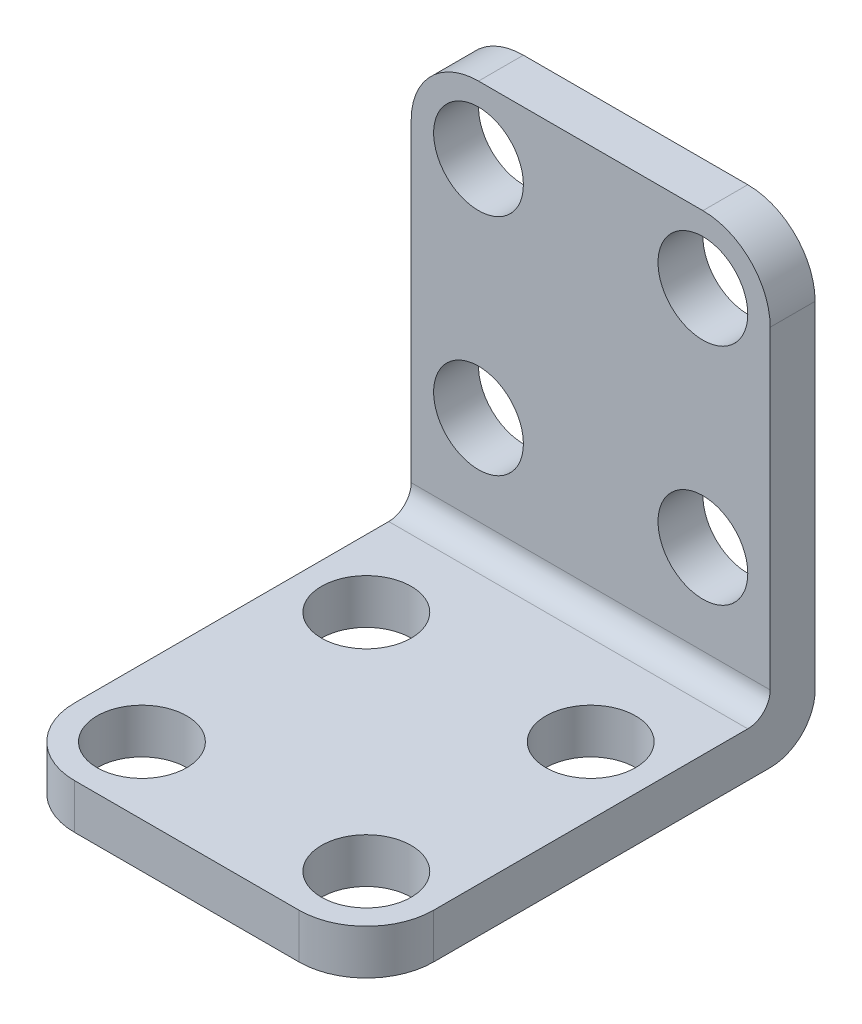
ISO-10303-21;
HEADER;
FILE_DESCRIPTION(('STEP AP214'),'2;1');
FILE_NAME('part.step','',(''),(''),'','','');
FILE_SCHEMA(('AUTOMOTIVE_DESIGN { 1 0 10303 214 1 1 1 1 }'));
ENDSEC;
DATA;
#1=APPLICATION_CONTEXT('core data for automotive mechanical design processes');
#2=APPLICATION_PROTOCOL_DEFINITION('international standard','automotive_design',2000,#1);
#3=PRODUCT_CONTEXT('',#1,'mechanical');
#4=PRODUCT('Part','Part','',(#3));
#5=PRODUCT_RELATED_PRODUCT_CATEGORY('part','',(#4));
#6=PRODUCT_DEFINITION_FORMATION('','',#4);
#7=PRODUCT_DEFINITION_CONTEXT('part definition',#1,'design');
#8=PRODUCT_DEFINITION('design','',#6,#7);
#9=PRODUCT_DEFINITION_SHAPE('','',#8);
#10=(LENGTH_UNIT() NAMED_UNIT(*) SI_UNIT(.MILLI.,.METRE.));
#11=(NAMED_UNIT(*) PLANE_ANGLE_UNIT() SI_UNIT($,.RADIAN.));
#12=(NAMED_UNIT(*) SI_UNIT($,.STERADIAN.) SOLID_ANGLE_UNIT());
#13=UNCERTAINTY_MEASURE_WITH_UNIT(LENGTH_MEASURE(1.E-05),#10,'distance_accuracy_value','');
#14=(GEOMETRIC_REPRESENTATION_CONTEXT(3) GLOBAL_UNCERTAINTY_ASSIGNED_CONTEXT((#13)) GLOBAL_UNIT_ASSIGNED_CONTEXT((#10,
#11,#12)) REPRESENTATION_CONTEXT('',''));
#15=CARTESIAN_POINT('',(0.,0.,0.));
#16=DIRECTION('',(0.,0.,1.));
#17=DIRECTION('',(1.,0.,0.));
#18=AXIS2_PLACEMENT_3D('',#15,#16,#17);
#19=CARTESIAN_POINT('',(-20.,-20.,50.));
#20=DIRECTION('',(0.,-1.,0.));
#21=DIRECTION('',(0.,0.,-1.));
#22=AXIS2_PLACEMENT_3D('',#19,#20,#21);
#23=PLANE('',#22);
#24=CARTESIAN_POINT('',(12.5,-20.,17.499999999992));
#25=DIRECTION('',(0.,1.,0.));
#26=DIRECTION('',(0.,0.,1.));
#27=AXIS2_PLACEMENT_3D('',#24,#25,#26);
#28=CIRCLE('',#27,4.99999999999999);
#29=CARTESIAN_POINT('',(12.5,-20.,22.499999999992));
#30=VERTEX_POINT('',#29);
#31=EDGE_CURVE('E341',#30,#30,#28,.T.);
#32=ORIENTED_EDGE('',*,*,#31,.F.);
#33=EDGE_LOOP('',(#32));
#34=FACE_BOUND('',#33,.T.);
#35=CARTESIAN_POINT('',(12.5,-20.,42.499999999992));
#36=DIRECTION('',(0.,1.,0.));
#37=DIRECTION('',(0.,0.,1.));
#38=AXIS2_PLACEMENT_3D('',#35,#36,#37);
#39=CIRCLE('',#38,4.99999999999999);
#40=CARTESIAN_POINT('',(12.5,-20.,47.499999999992));
#41=VERTEX_POINT('',#40);
#42=EDGE_CURVE('E335',#41,#41,#39,.T.);
#43=ORIENTED_EDGE('',*,*,#42,.F.);
#44=EDGE_LOOP('',(#43));
#45=FACE_BOUND('',#44,.T.);
#46=CARTESIAN_POINT('',(-12.5,-20.,42.499999999992));
#47=DIRECTION('',(0.,1.,0.));
#48=DIRECTION('',(0.,0.,1.));
#49=AXIS2_PLACEMENT_3D('',#46,#47,#48);
#50=CIRCLE('',#49,4.99999999999999);
#51=CARTESIAN_POINT('',(-12.5,-20.,47.499999999992));
#52=VERTEX_POINT('',#51);
#53=EDGE_CURVE('E329',#52,#52,#50,.T.);
#54=ORIENTED_EDGE('',*,*,#53,.F.);
#55=EDGE_LOOP('',(#54));
#56=FACE_BOUND('',#55,.T.);
#57=DIRECTION('',(0.,0.,-1.));
#58=VECTOR('',#57,1.);
#59=CARTESIAN_POINT('',(-20.,-20.,50.));
#60=LINE('',#59,#58);
#61=CARTESIAN_POINT('',(-20.,-20.,42.5));
#62=VERTEX_POINT('',#61);
#63=CARTESIAN_POINT('',(-20.,-20.,7.50000000000001));
#64=VERTEX_POINT('',#63);
#65=EDGE_CURVE('E123',#62,#64,#60,.T.);
#66=ORIENTED_EDGE('',*,*,#65,.F.);
#67=CARTESIAN_POINT('',(-12.5,-20.,42.5));
#68=DIRECTION('',(0.,-1.,0.));
#69=DIRECTION('',(0.,0.,-1.));
#70=AXIS2_PLACEMENT_3D('',#67,#68,#69);
#71=CIRCLE('',#70,7.5);
#72=CARTESIAN_POINT('',(-12.5,-20.,50.));
#73=VERTEX_POINT('',#72);
#74=EDGE_CURVE('E184',#62,#73,#71,.F.);
#75=ORIENTED_EDGE('',*,*,#74,.T.);
#76=DIRECTION('',(-1.,0.,0.));
#77=VECTOR('',#76,1.);
#78=CARTESIAN_POINT('',(-20.,-20.,50.));
#79=LINE('',#78,#77);
#80=CARTESIAN_POINT('',(12.5,-20.,50.));
#81=VERTEX_POINT('',#80);
#82=EDGE_CURVE('E136',#81,#73,#79,.T.);
#83=ORIENTED_EDGE('',*,*,#82,.F.);
#84=CARTESIAN_POINT('',(12.5,-20.,42.5));
#85=DIRECTION('',(0.,-1.,0.));
#86=DIRECTION('',(0.,0.,-1.));
#87=AXIS2_PLACEMENT_3D('',#84,#85,#86);
#88=CIRCLE('',#87,7.5);
#89=CARTESIAN_POINT('',(20.,-20.,42.5));
#90=VERTEX_POINT('',#89);
#91=EDGE_CURVE('E182',#81,#90,#88,.F.);
#92=ORIENTED_EDGE('',*,*,#91,.T.);
#93=DIRECTION('',(0.,0.,-1.));
#94=VECTOR('',#93,1.);
#95=CARTESIAN_POINT('',(20.,-20.,50.));
#96=LINE('',#95,#94);
#97=CARTESIAN_POINT('',(20.,-20.,7.50000000000001));
#98=VERTEX_POINT('',#97);
#99=EDGE_CURVE('E135',#90,#98,#96,.T.);
#100=ORIENTED_EDGE('',*,*,#99,.T.);
#101=DIRECTION('',(-1.,0.,0.));
#102=VECTOR('',#101,1.);
#103=CARTESIAN_POINT('',(-20.,-20.,7.5));
#104=LINE('',#103,#102);
#105=EDGE_CURVE('E142',#98,#64,#104,.T.);
#106=ORIENTED_EDGE('',*,*,#105,.T.);
#107=EDGE_LOOP('',(#66,#75,#83,#92,#100,#106));
#108=FACE_BOUND('',#107,.T.);
#109=CARTESIAN_POINT('',(-12.5,-20.,17.499999999992));
#110=DIRECTION('',(0.,1.,0.));
#111=DIRECTION('',(0.,0.,1.));
#112=AXIS2_PLACEMENT_3D('',#109,#110,#111);
#113=CIRCLE('',#112,4.99999999999999);
#114=CARTESIAN_POINT('',(-12.5,-20.,22.499999999992));
#115=VERTEX_POINT('',#114);
#116=EDGE_CURVE('E347',#115,#115,#113,.T.);
#117=ORIENTED_EDGE('',*,*,#116,.F.);
#118=EDGE_LOOP('',(#117));
#119=FACE_BOUND('',#118,.T.);
#120=ADVANCED_FACE('F34',(#34,#45,#56,#108,#119),#23,.F.);
#121=CARTESIAN_POINT('',(0.,0.,5.));
#122=DIRECTION('',(0.,0.,-1.));
#123=DIRECTION('',(-1.,0.,0.));
#124=AXIS2_PLACEMENT_3D('',#121,#122,#123);
#125=PLANE('',#124);
#126=CARTESIAN_POINT('',(-12.5,-7.5,5.));
#127=DIRECTION('',(0.,0.,1.));
#128=DIRECTION('',(1.,0.,0.));
#129=AXIS2_PLACEMENT_3D('',#126,#127,#128);
#130=CIRCLE('',#129,4.99999999999999);
#131=CARTESIAN_POINT('',(-7.50000000000001,-7.5,5.));
#132=VERTEX_POINT('',#131);
#133=EDGE_CURVE('E317',#132,#132,#130,.T.);
#134=ORIENTED_EDGE('',*,*,#133,.F.);
#135=EDGE_LOOP('',(#134));
#136=FACE_BOUND('',#135,.T.);
#137=CARTESIAN_POINT('',(12.5,-7.5,5.));
#138=DIRECTION('',(0.,0.,1.));
#139=DIRECTION('',(1.,0.,0.));
#140=AXIS2_PLACEMENT_3D('',#137,#138,#139);
#141=CIRCLE('',#140,4.99999999999999);
#142=CARTESIAN_POINT('',(17.5,-7.5,5.));
#143=VERTEX_POINT('',#142);
#144=EDGE_CURVE('E311',#143,#143,#141,.T.);
#145=ORIENTED_EDGE('',*,*,#144,.F.);
#146=EDGE_LOOP('',(#145));
#147=FACE_BOUND('',#146,.T.);
#148=CARTESIAN_POINT('',(12.5,17.5,5.));
#149=DIRECTION('',(0.,0.,1.));
#150=DIRECTION('',(1.,0.,0.));
#151=AXIS2_PLACEMENT_3D('',#148,#149,#150);
#152=CIRCLE('',#151,4.99999999999999);
#153=CARTESIAN_POINT('',(17.5,17.5,5.));
#154=VERTEX_POINT('',#153);
#155=EDGE_CURVE('E305',#154,#154,#152,.T.);
#156=ORIENTED_EDGE('',*,*,#155,.F.);
#157=EDGE_LOOP('',(#156));
#158=FACE_BOUND('',#157,.T.);
#159=DIRECTION('',(0.,1.,0.));
#160=VECTOR('',#159,1.);
#161=CARTESIAN_POINT('',(20.,-25.,5.));
#162=LINE('',#161,#160);
#163=CARTESIAN_POINT('',(20.,-17.5,5.));
#164=VERTEX_POINT('',#163);
#165=CARTESIAN_POINT('',(20.,17.5,5.));
#166=VERTEX_POINT('',#165);
#167=EDGE_CURVE('E216',#164,#166,#162,.T.);
#168=ORIENTED_EDGE('',*,*,#167,.T.);
#169=CARTESIAN_POINT('',(12.5,17.5,5.));
#170=DIRECTION('',(0.,0.,-1.));
#171=DIRECTION('',(-1.,0.,0.));
#172=AXIS2_PLACEMENT_3D('',#169,#170,#171);
#173=CIRCLE('',#172,7.5);
#174=CARTESIAN_POINT('',(12.5,25.,5.));
#175=VERTEX_POINT('',#174);
#176=EDGE_CURVE('E11',#166,#175,#173,.F.);
#177=ORIENTED_EDGE('',*,*,#176,.T.);
#178=DIRECTION('',(-1.,0.,0.));
#179=VECTOR('',#178,1.);
#180=CARTESIAN_POINT('',(-20.,25.,5.));
#181=LINE('',#180,#179);
#182=CARTESIAN_POINT('',(-12.5,25.,5.));
#183=VERTEX_POINT('',#182);
#184=EDGE_CURVE('E201',#175,#183,#181,.T.);
#185=ORIENTED_EDGE('',*,*,#184,.T.);
#186=CARTESIAN_POINT('',(-12.5,17.5,5.));
#187=DIRECTION('',(0.,0.,-1.));
#188=DIRECTION('',(-1.,0.,0.));
#189=AXIS2_PLACEMENT_3D('',#186,#187,#188);
#190=CIRCLE('',#189,7.5);
#191=CARTESIAN_POINT('',(-20.,17.5,5.));
#192=VERTEX_POINT('',#191);
#193=EDGE_CURVE('E42',#183,#192,#190,.F.);
#194=ORIENTED_EDGE('',*,*,#193,.T.);
#195=DIRECTION('',(0.,-1.,0.));
#196=VECTOR('',#195,1.);
#197=CARTESIAN_POINT('',(-20.,-25.,5.));
#198=LINE('',#197,#196);
#199=CARTESIAN_POINT('',(-20.,-17.5,5.));
#200=VERTEX_POINT('',#199);
#201=EDGE_CURVE('E200',#192,#200,#198,.T.);
#202=ORIENTED_EDGE('',*,*,#201,.T.);
#203=DIRECTION('',(-1.,0.,0.));
#204=VECTOR('',#203,1.);
#205=CARTESIAN_POINT('',(20.,-17.5,5.));
#206=LINE('',#205,#204);
#207=EDGE_CURVE('E143',#200,#164,#206,.F.);
#208=ORIENTED_EDGE('',*,*,#207,.T.);
#209=EDGE_LOOP('',(#168,#177,#185,#194,#202,#208));
#210=FACE_BOUND('',#209,.T.);
#211=CARTESIAN_POINT('',(-12.5,17.5,5.));
#212=DIRECTION('',(0.,0.,1.));
#213=DIRECTION('',(1.,0.,0.));
#214=AXIS2_PLACEMENT_3D('',#211,#212,#213);
#215=CIRCLE('',#214,4.99999999999999);
#216=CARTESIAN_POINT('',(-7.50000000000001,17.5,5.));
#217=VERTEX_POINT('',#216);
#218=EDGE_CURVE('E323',#217,#217,#215,.T.);
#219=ORIENTED_EDGE('',*,*,#218,.F.);
#220=EDGE_LOOP('',(#219));
#221=FACE_BOUND('',#220,.T.);
#222=ADVANCED_FACE('F198',(#136,#147,#158,#210,#221),#125,.F.);
#223=CARTESIAN_POINT('',(0.,0.,0.));
#224=DIRECTION('',(0.,0.,-1.));
#225=DIRECTION('',(-1.,0.,0.));
#226=AXIS2_PLACEMENT_3D('',#223,#224,#225);
#227=PLANE('',#226);
#228=CARTESIAN_POINT('',(-12.5,17.5,0.));
#229=DIRECTION('',(0.,0.,1.));
#230=DIRECTION('',(1.,0.,0.));
#231=AXIS2_PLACEMENT_3D('',#228,#229,#230);
#232=CIRCLE('',#231,5.);
#233=CARTESIAN_POINT('',(-7.5,17.5,0.));
#234=VERTEX_POINT('',#233);
#235=EDGE_CURVE('E320',#234,#234,#232,.T.);
#236=ORIENTED_EDGE('',*,*,#235,.T.);
#237=EDGE_LOOP('',(#236));
#238=FACE_BOUND('',#237,.T.);
#239=DIRECTION('',(-1.,0.,0.));
#240=VECTOR('',#239,1.);
#241=CARTESIAN_POINT('',(-20.,25.,0.));
#242=LINE('',#241,#240);
#243=CARTESIAN_POINT('',(12.5,25.,0.));
#244=VERTEX_POINT('',#243);
#245=CARTESIAN_POINT('',(-12.5,25.,0.));
#246=VERTEX_POINT('',#245);
#247=EDGE_CURVE('E210',#244,#246,#242,.T.);
#248=ORIENTED_EDGE('',*,*,#247,.F.);
#249=CARTESIAN_POINT('',(12.5,17.5,0.));
#250=DIRECTION('',(0.,0.,-1.));
#251=DIRECTION('',(-1.,0.,0.));
#252=AXIS2_PLACEMENT_3D('',#249,#250,#251);
#253=CIRCLE('',#252,7.5);
#254=CARTESIAN_POINT('',(20.,17.5,0.));
#255=VERTEX_POINT('',#254);
#256=EDGE_CURVE('E196',#244,#255,#253,.T.);
#257=ORIENTED_EDGE('',*,*,#256,.T.);
#258=DIRECTION('',(0.,1.,0.));
#259=VECTOR('',#258,1.);
#260=CARTESIAN_POINT('',(20.,-25.,0.));
#261=LINE('',#260,#259);
#262=CARTESIAN_POINT('',(20.,-20.,0.));
#263=VERTEX_POINT('',#262);
#264=EDGE_CURVE('E214',#263,#255,#261,.T.);
#265=ORIENTED_EDGE('',*,*,#264,.F.);
#266=DIRECTION('',(1.,0.,0.));
#267=VECTOR('',#266,1.);
#268=CARTESIAN_POINT('',(-20.,-20.,0.));
#269=LINE('',#268,#267);
#270=CARTESIAN_POINT('',(-20.,-20.,0.));
#271=VERTEX_POINT('',#270);
#272=EDGE_CURVE('E162',#263,#271,#269,.F.);
#273=ORIENTED_EDGE('',*,*,#272,.T.);
#274=DIRECTION('',(0.,-1.,0.));
#275=VECTOR('',#274,1.);
#276=CARTESIAN_POINT('',(-20.,-25.,0.));
#277=LINE('',#276,#275);
#278=CARTESIAN_POINT('',(-20.,17.5,0.));
#279=VERTEX_POINT('',#278);
#280=EDGE_CURVE('E211',#279,#271,#277,.T.);
#281=ORIENTED_EDGE('',*,*,#280,.F.);
#282=CARTESIAN_POINT('',(-12.5,17.5,0.));
#283=DIRECTION('',(0.,0.,-1.));
#284=DIRECTION('',(-1.,0.,0.));
#285=AXIS2_PLACEMENT_3D('',#282,#283,#284);
#286=CIRCLE('',#285,7.5);
#287=EDGE_CURVE('E194',#279,#246,#286,.T.);
#288=ORIENTED_EDGE('',*,*,#287,.T.);
#289=EDGE_LOOP('',(#248,#257,#265,#273,#281,#288));
#290=FACE_BOUND('',#289,.T.);
#291=CARTESIAN_POINT('',(12.5,17.5,0.));
#292=DIRECTION('',(0.,0.,1.));
#293=DIRECTION('',(1.,0.,0.));
#294=AXIS2_PLACEMENT_3D('',#291,#292,#293);
#295=CIRCLE('',#294,5.);
#296=CARTESIAN_POINT('',(17.5,17.5,0.));
#297=VERTEX_POINT('',#296);
#298=EDGE_CURVE('E297',#297,#297,#295,.T.);
#299=ORIENTED_EDGE('',*,*,#298,.T.);
#300=EDGE_LOOP('',(#299));
#301=FACE_BOUND('',#300,.T.);
#302=CARTESIAN_POINT('',(12.5,-7.5,0.));
#303=DIRECTION('',(0.,0.,1.));
#304=DIRECTION('',(1.,0.,0.));
#305=AXIS2_PLACEMENT_3D('',#302,#303,#304);
#306=CIRCLE('',#305,5.);
#307=CARTESIAN_POINT('',(17.5,-7.5,0.));
#308=VERTEX_POINT('',#307);
#309=EDGE_CURVE('E308',#308,#308,#306,.T.);
#310=ORIENTED_EDGE('',*,*,#309,.T.);
#311=EDGE_LOOP('',(#310));
#312=FACE_BOUND('',#311,.T.);
#313=CARTESIAN_POINT('',(-12.5,-7.5,0.));
#314=DIRECTION('',(0.,0.,1.));
#315=DIRECTION('',(1.,0.,0.));
#316=AXIS2_PLACEMENT_3D('',#313,#314,#315);
#317=CIRCLE('',#316,5.);
#318=CARTESIAN_POINT('',(-7.5,-7.5,0.));
#319=VERTEX_POINT('',#318);
#320=EDGE_CURVE('E314',#319,#319,#317,.T.);
#321=ORIENTED_EDGE('',*,*,#320,.T.);
#322=EDGE_LOOP('',(#321));
#323=FACE_BOUND('',#322,.T.);
#324=ADVANCED_FACE('F208',(#238,#290,#301,#312,#323),#227,.T.);
#325=CARTESIAN_POINT('',(20.,-25.,5.));
#326=DIRECTION('',(-1.,0.,0.));
#327=DIRECTION('',(0.,0.,1.));
#328=AXIS2_PLACEMENT_3D('',#325,#326,#327);
#329=PLANE('',#328);
#330=ORIENTED_EDGE('',*,*,#99,.F.);
#331=DIRECTION('',(0.,1.,0.));
#332=VECTOR('',#331,1.);
#333=CARTESIAN_POINT('',(20.,-25.,42.5));
#334=LINE('',#333,#332);
#335=CARTESIAN_POINT('',(20.,-25.,42.5));
#336=VERTEX_POINT('',#335);
#337=EDGE_CURVE('E188',#90,#336,#334,.F.);
#338=ORIENTED_EDGE('',*,*,#337,.T.);
#339=DIRECTION('',(0.,0.,-1.));
#340=VECTOR('',#339,1.);
#341=CARTESIAN_POINT('',(20.,-25.,5.));
#342=LINE('',#341,#340);
#343=CARTESIAN_POINT('',(20.,-25.,5.));
#344=VERTEX_POINT('',#343);
#345=EDGE_CURVE('E152',#336,#344,#342,.T.);
#346=ORIENTED_EDGE('',*,*,#345,.T.);
#347=CARTESIAN_POINT('',(20.,-20.,5.));
#348=DIRECTION('',(-1.,0.,0.));
#349=DIRECTION('',(0.,0.,1.));
#350=AXIS2_PLACEMENT_3D('',#347,#348,#349);
#351=CIRCLE('',#350,5.);
#352=EDGE_CURVE('E160',#344,#263,#351,.F.);
#353=ORIENTED_EDGE('',*,*,#352,.T.);
#354=ORIENTED_EDGE('',*,*,#264,.T.);
#355=DIRECTION('',(0.,0.,-1.));
#356=VECTOR('',#355,1.);
#357=CARTESIAN_POINT('',(20.,17.5,5.));
#358=LINE('',#357,#356);
#359=EDGE_CURVE('E186',#255,#166,#358,.F.);
#360=ORIENTED_EDGE('',*,*,#359,.T.);
#361=ORIENTED_EDGE('',*,*,#167,.F.);
#362=CARTESIAN_POINT('',(20.,-17.5,7.5));
#363=DIRECTION('',(-1.,0.,0.));
#364=DIRECTION('',(0.,0.,1.));
#365=AXIS2_PLACEMENT_3D('',#362,#363,#364);
#366=CIRCLE('',#365,2.5);
#367=EDGE_CURVE('E144',#164,#98,#366,.T.);
#368=ORIENTED_EDGE('',*,*,#367,.T.);
#369=EDGE_LOOP('',(#330,#338,#346,#353,#354,#360,#361,#368));
#370=FACE_BOUND('',#369,.T.);
#371=ADVANCED_FACE('F223',(#370),#329,.F.);
#372=CARTESIAN_POINT('',(-20.,25.,5.));
#373=DIRECTION('',(0.,-1.,0.));
#374=DIRECTION('',(0.,0.,-1.));
#375=AXIS2_PLACEMENT_3D('',#372,#373,#374);
#376=PLANE('',#375);
#377=ORIENTED_EDGE('',*,*,#184,.F.);
#378=DIRECTION('',(0.,0.,-1.));
#379=VECTOR('',#378,1.);
#380=CARTESIAN_POINT('',(12.5,25.,5.));
#381=LINE('',#380,#379);
#382=EDGE_CURVE('E191',#175,#244,#381,.T.);
#383=ORIENTED_EDGE('',*,*,#382,.T.);
#384=ORIENTED_EDGE('',*,*,#247,.T.);
#385=DIRECTION('',(0.,0.,-1.));
#386=VECTOR('',#385,1.);
#387=CARTESIAN_POINT('',(-12.5,25.,5.));
#388=LINE('',#387,#386);
#389=EDGE_CURVE('E49',#246,#183,#388,.F.);
#390=ORIENTED_EDGE('',*,*,#389,.T.);
#391=EDGE_LOOP('',(#377,#383,#384,#390));
#392=FACE_BOUND('',#391,.T.);
#393=ADVANCED_FACE('F212',(#392),#376,.F.);
#394=CARTESIAN_POINT('',(-20.,-25.,5.));
#395=DIRECTION('',(1.,0.,0.));
#396=DIRECTION('',(0.,0.,-1.));
#397=AXIS2_PLACEMENT_3D('',#394,#395,#396);
#398=PLANE('',#397);
#399=DIRECTION('',(0.,0.,-1.));
#400=VECTOR('',#399,1.);
#401=CARTESIAN_POINT('',(-20.,-25.,5.));
#402=LINE('',#401,#400);
#403=CARTESIAN_POINT('',(-20.,-25.,42.5));
#404=VERTEX_POINT('',#403);
#405=CARTESIAN_POINT('',(-20.,-25.,5.));
#406=VERTEX_POINT('',#405);
#407=EDGE_CURVE('E149',#404,#406,#402,.T.);
#408=ORIENTED_EDGE('',*,*,#407,.F.);
#409=DIRECTION('',(0.,-1.,0.));
#410=VECTOR('',#409,1.);
#411=CARTESIAN_POINT('',(-20.,-25.,42.5));
#412=LINE('',#411,#410);
#413=EDGE_CURVE('E131',#404,#62,#412,.F.);
#414=ORIENTED_EDGE('',*,*,#413,.T.);
#415=ORIENTED_EDGE('',*,*,#65,.T.);
#416=CARTESIAN_POINT('',(-20.,-17.5,7.5));
#417=DIRECTION('',(1.,0.,0.));
#418=DIRECTION('',(0.,0.,-1.));
#419=AXIS2_PLACEMENT_3D('',#416,#417,#418);
#420=CIRCLE('',#419,2.5);
#421=EDGE_CURVE('E128',#64,#200,#420,.T.);
#422=ORIENTED_EDGE('',*,*,#421,.T.);
#423=ORIENTED_EDGE('',*,*,#201,.F.);
#424=DIRECTION('',(0.,0.,-1.));
#425=VECTOR('',#424,1.);
#426=CARTESIAN_POINT('',(-20.,17.5,5.));
#427=LINE('',#426,#425);
#428=EDGE_CURVE('E178',#192,#279,#427,.T.);
#429=ORIENTED_EDGE('',*,*,#428,.T.);
#430=ORIENTED_EDGE('',*,*,#280,.T.);
#431=CARTESIAN_POINT('',(-20.,-20.,5.));
#432=DIRECTION('',(1.,0.,0.));
#433=DIRECTION('',(0.,0.,-1.));
#434=AXIS2_PLACEMENT_3D('',#431,#432,#433);
#435=CIRCLE('',#434,5.);
#436=EDGE_CURVE('E165',#271,#406,#435,.F.);
#437=ORIENTED_EDGE('',*,*,#436,.T.);
#438=EDGE_LOOP('',(#408,#414,#415,#422,#423,#429,#430,#437));
#439=FACE_BOUND('',#438,.T.);
#440=ADVANCED_FACE('F126',(#439),#398,.F.);
#441=CARTESIAN_POINT('',(-20.,-25.,5.));
#442=DIRECTION('',(0.,1.,0.));
#443=DIRECTION('',(0.,0.,1.));
#444=AXIS2_PLACEMENT_3D('',#441,#442,#443);
#445=PLANE('',#444);
#446=CARTESIAN_POINT('',(-12.5,-25.,17.499999999992));
#447=DIRECTION('',(0.,1.,0.));
#448=DIRECTION('',(0.,0.,1.));
#449=AXIS2_PLACEMENT_3D('',#446,#447,#448);
#450=CIRCLE('',#449,5.);
#451=CARTESIAN_POINT('',(-12.5,-25.,22.499999999992));
#452=VERTEX_POINT('',#451);
#453=EDGE_CURVE('E344',#452,#452,#450,.T.);
#454=ORIENTED_EDGE('',*,*,#453,.T.);
#455=EDGE_LOOP('',(#454));
#456=FACE_BOUND('',#455,.T.);
#457=CARTESIAN_POINT('',(12.5,-25.,17.499999999992));
#458=DIRECTION('',(0.,1.,0.));
#459=DIRECTION('',(0.,0.,1.));
#460=AXIS2_PLACEMENT_3D('',#457,#458,#459);
#461=CIRCLE('',#460,5.);
#462=CARTESIAN_POINT('',(12.5,-25.,22.499999999992));
#463=VERTEX_POINT('',#462);
#464=EDGE_CURVE('E338',#463,#463,#461,.T.);
#465=ORIENTED_EDGE('',*,*,#464,.T.);
#466=EDGE_LOOP('',(#465));
#467=FACE_BOUND('',#466,.T.);
#468=CARTESIAN_POINT('',(12.5,-25.,42.499999999992));
#469=DIRECTION('',(0.,1.,0.));
#470=DIRECTION('',(0.,0.,1.));
#471=AXIS2_PLACEMENT_3D('',#468,#469,#470);
#472=CIRCLE('',#471,5.);
#473=CARTESIAN_POINT('',(12.5,-25.,47.499999999992));
#474=VERTEX_POINT('',#473);
#475=EDGE_CURVE('E332',#474,#474,#472,.T.);
#476=ORIENTED_EDGE('',*,*,#475,.T.);
#477=EDGE_LOOP('',(#476));
#478=FACE_BOUND('',#477,.T.);
#479=CARTESIAN_POINT('',(-12.5,-25.,42.499999999992));
#480=DIRECTION('',(0.,1.,0.));
#481=DIRECTION('',(0.,0.,1.));
#482=AXIS2_PLACEMENT_3D('',#479,#480,#481);
#483=CIRCLE('',#482,5.);
#484=CARTESIAN_POINT('',(-12.5,-25.,47.499999999992));
#485=VERTEX_POINT('',#484);
#486=EDGE_CURVE('E326',#485,#485,#483,.T.);
#487=ORIENTED_EDGE('',*,*,#486,.T.);
#488=EDGE_LOOP('',(#487));
#489=FACE_BOUND('',#488,.T.);
#490=DIRECTION('',(1.,0.,0.));
#491=VECTOR('',#490,1.);
#492=CARTESIAN_POINT('',(-20.,-25.,50.));
#493=LINE('',#492,#491);
#494=CARTESIAN_POINT('',(-12.5,-25.,50.));
#495=VERTEX_POINT('',#494);
#496=CARTESIAN_POINT('',(12.5,-25.,50.));
#497=VERTEX_POINT('',#496);
#498=EDGE_CURVE('E295',#495,#497,#493,.T.);
#499=ORIENTED_EDGE('',*,*,#498,.F.);
#500=CARTESIAN_POINT('',(-12.5,-25.,42.5));
#501=DIRECTION('',(0.,1.,0.));
#502=DIRECTION('',(0.,0.,1.));
#503=AXIS2_PLACEMENT_3D('',#500,#501,#502);
#504=CIRCLE('',#503,7.5);
#505=EDGE_CURVE('E176',#495,#404,#504,.F.);
#506=ORIENTED_EDGE('',*,*,#505,.T.);
#507=ORIENTED_EDGE('',*,*,#407,.T.);
#508=DIRECTION('',(1.,0.,0.));
#509=VECTOR('',#508,1.);
#510=CARTESIAN_POINT('',(20.,-25.,5.));
#511=LINE('',#510,#509);
#512=EDGE_CURVE('E157',#406,#344,#511,.T.);
#513=ORIENTED_EDGE('',*,*,#512,.T.);
#514=ORIENTED_EDGE('',*,*,#345,.F.);
#515=CARTESIAN_POINT('',(12.5,-25.,42.5));
#516=DIRECTION('',(0.,1.,0.));
#517=DIRECTION('',(0.,0.,1.));
#518=AXIS2_PLACEMENT_3D('',#515,#516,#517);
#519=CIRCLE('',#518,7.5);
#520=EDGE_CURVE('E174',#336,#497,#519,.F.);
#521=ORIENTED_EDGE('',*,*,#520,.T.);
#522=EDGE_LOOP('',(#499,#506,#507,#513,#514,#521));
#523=FACE_BOUND('',#522,.T.);
#524=ADVANCED_FACE('F234',(#456,#467,#478,#489,#523),#445,.F.);
#525=CARTESIAN_POINT('',(0.,0.,50.));
#526=DIRECTION('',(0.,0.,-1.));
#527=DIRECTION('',(-1.,0.,0.));
#528=AXIS2_PLACEMENT_3D('',#525,#526,#527);
#529=PLANE('',#528);
#530=ORIENTED_EDGE('',*,*,#82,.T.);
#531=DIRECTION('',(0.,-1.,0.));
#532=VECTOR('',#531,1.);
#533=CARTESIAN_POINT('',(-12.5,0.,50.));
#534=LINE('',#533,#532);
#535=EDGE_CURVE('E171',#73,#495,#534,.T.);
#536=ORIENTED_EDGE('',*,*,#535,.T.);
#537=ORIENTED_EDGE('',*,*,#498,.T.);
#538=DIRECTION('',(0.,1.,0.));
#539=VECTOR('',#538,1.);
#540=CARTESIAN_POINT('',(12.5,0.,50.));
#541=LINE('',#540,#539);
#542=EDGE_CURVE('E168',#497,#81,#541,.T.);
#543=ORIENTED_EDGE('',*,*,#542,.T.);
#544=EDGE_LOOP('',(#530,#536,#537,#543));
#545=FACE_BOUND('',#544,.T.);
#546=ADVANCED_FACE('F260',(#545),#529,.F.);
#547=CARTESIAN_POINT('',(-20.,-17.5,7.5));
#548=DIRECTION('',(1.,0.,0.));
#549=DIRECTION('',(0.,0.,-1.));
#550=AXIS2_PLACEMENT_3D('',#547,#548,#549);
#551=CYLINDRICAL_SURFACE('',#550,2.5);
#552=ORIENTED_EDGE('',*,*,#367,.F.);
#553=ORIENTED_EDGE('',*,*,#207,.F.);
#554=ORIENTED_EDGE('',*,*,#421,.F.);
#555=ORIENTED_EDGE('',*,*,#105,.F.);
#556=EDGE_LOOP('',(#552,#553,#554,#555));
#557=FACE_BOUND('',#556,.T.);
#558=ADVANCED_FACE('F141',(#557),#551,.F.);
#559=CARTESIAN_POINT('',(-20.,-20.,5.));
#560=DIRECTION('',(-1.,0.,0.));
#561=DIRECTION('',(0.,0.,1.));
#562=AXIS2_PLACEMENT_3D('',#559,#560,#561);
#563=CYLINDRICAL_SURFACE('',#562,5.);
#564=ORIENTED_EDGE('',*,*,#436,.F.);
#565=ORIENTED_EDGE('',*,*,#272,.F.);
#566=ORIENTED_EDGE('',*,*,#352,.F.);
#567=ORIENTED_EDGE('',*,*,#512,.F.);
#568=EDGE_LOOP('',(#564,#565,#566,#567));
#569=FACE_BOUND('',#568,.T.);
#570=ADVANCED_FACE('F232',(#569),#563,.T.);
#571=CARTESIAN_POINT('',(12.5,17.5,5.));
#572=DIRECTION('',(0.,0.,1.));
#573=DIRECTION('',(1.,0.,0.));
#574=AXIS2_PLACEMENT_3D('',#571,#572,#573);
#575=CYLINDRICAL_SURFACE('',#574,4.99999999999999);
#576=ORIENTED_EDGE('',*,*,#298,.F.);
#577=EDGE_LOOP('',(#576));
#578=FACE_BOUND('',#577,.T.);
#579=ORIENTED_EDGE('',*,*,#155,.T.);
#580=EDGE_LOOP('',(#579));
#581=FACE_BOUND('',#580,.T.);
#582=ADVANCED_FACE('F279',(#578,#581),#575,.F.);
#583=CARTESIAN_POINT('',(12.5,-7.5,5.));
#584=DIRECTION('',(0.,0.,1.));
#585=DIRECTION('',(1.,0.,0.));
#586=AXIS2_PLACEMENT_3D('',#583,#584,#585);
#587=CYLINDRICAL_SURFACE('',#586,4.99999999999999);
#588=ORIENTED_EDGE('',*,*,#309,.F.);
#589=EDGE_LOOP('',(#588));
#590=FACE_BOUND('',#589,.T.);
#591=ORIENTED_EDGE('',*,*,#144,.T.);
#592=EDGE_LOOP('',(#591));
#593=FACE_BOUND('',#592,.T.);
#594=ADVANCED_FACE('F372',(#590,#593),#587,.F.);
#595=CARTESIAN_POINT('',(-12.5,-7.5,5.));
#596=DIRECTION('',(0.,0.,1.));
#597=DIRECTION('',(1.,0.,0.));
#598=AXIS2_PLACEMENT_3D('',#595,#596,#597);
#599=CYLINDRICAL_SURFACE('',#598,4.99999999999999);
#600=ORIENTED_EDGE('',*,*,#320,.F.);
#601=EDGE_LOOP('',(#600));
#602=FACE_BOUND('',#601,.T.);
#603=ORIENTED_EDGE('',*,*,#133,.T.);
#604=EDGE_LOOP('',(#603));
#605=FACE_BOUND('',#604,.T.);
#606=ADVANCED_FACE('F286',(#602,#605),#599,.F.);
#607=CARTESIAN_POINT('',(-12.5,17.5,5.));
#608=DIRECTION('',(0.,0.,1.));
#609=DIRECTION('',(1.,0.,0.));
#610=AXIS2_PLACEMENT_3D('',#607,#608,#609);
#611=CYLINDRICAL_SURFACE('',#610,4.99999999999999);
#612=ORIENTED_EDGE('',*,*,#235,.F.);
#613=EDGE_LOOP('',(#612));
#614=FACE_BOUND('',#613,.T.);
#615=ORIENTED_EDGE('',*,*,#218,.T.);
#616=EDGE_LOOP('',(#615));
#617=FACE_BOUND('',#616,.T.);
#618=ADVANCED_FACE('F281',(#614,#617),#611,.F.);
#619=CARTESIAN_POINT('',(-12.5,0.,42.5));
#620=DIRECTION('',(0.,-1.,0.));
#621=DIRECTION('',(0.,0.,-1.));
#622=AXIS2_PLACEMENT_3D('',#619,#620,#621);
#623=CYLINDRICAL_SURFACE('',#622,7.5);
#624=ORIENTED_EDGE('',*,*,#74,.F.);
#625=ORIENTED_EDGE('',*,*,#413,.F.);
#626=ORIENTED_EDGE('',*,*,#505,.F.);
#627=ORIENTED_EDGE('',*,*,#535,.F.);
#628=EDGE_LOOP('',(#624,#625,#626,#627));
#629=FACE_BOUND('',#628,.T.);
#630=ADVANCED_FACE('F246',(#629),#623,.T.);
#631=CARTESIAN_POINT('',(12.5,0.,42.5));
#632=DIRECTION('',(0.,1.,0.));
#633=DIRECTION('',(0.,0.,1.));
#634=AXIS2_PLACEMENT_3D('',#631,#632,#633);
#635=CYLINDRICAL_SURFACE('',#634,7.5);
#636=ORIENTED_EDGE('',*,*,#520,.F.);
#637=ORIENTED_EDGE('',*,*,#337,.F.);
#638=ORIENTED_EDGE('',*,*,#91,.F.);
#639=ORIENTED_EDGE('',*,*,#542,.F.);
#640=EDGE_LOOP('',(#636,#637,#638,#639));
#641=FACE_BOUND('',#640,.T.);
#642=ADVANCED_FACE('F240',(#641),#635,.T.);
#643=CARTESIAN_POINT('',(12.5,17.5,5.));
#644=DIRECTION('',(0.,0.,-1.));
#645=DIRECTION('',(-1.,0.,0.));
#646=AXIS2_PLACEMENT_3D('',#643,#644,#645);
#647=CYLINDRICAL_SURFACE('',#646,7.5);
#648=ORIENTED_EDGE('',*,*,#176,.F.);
#649=ORIENTED_EDGE('',*,*,#359,.F.);
#650=ORIENTED_EDGE('',*,*,#256,.F.);
#651=ORIENTED_EDGE('',*,*,#382,.F.);
#652=EDGE_LOOP('',(#648,#649,#650,#651));
#653=FACE_BOUND('',#652,.T.);
#654=ADVANCED_FACE('F238',(#653),#647,.T.);
#655=CARTESIAN_POINT('',(-12.5,17.5,5.));
#656=DIRECTION('',(0.,0.,-1.));
#657=DIRECTION('',(-1.,0.,0.));
#658=AXIS2_PLACEMENT_3D('',#655,#656,#657);
#659=CYLINDRICAL_SURFACE('',#658,7.5);
#660=ORIENTED_EDGE('',*,*,#193,.F.);
#661=ORIENTED_EDGE('',*,*,#389,.F.);
#662=ORIENTED_EDGE('',*,*,#287,.F.);
#663=ORIENTED_EDGE('',*,*,#428,.F.);
#664=EDGE_LOOP('',(#660,#661,#662,#663));
#665=FACE_BOUND('',#664,.T.);
#666=ADVANCED_FACE('F36',(#665),#659,.T.);
#667=CARTESIAN_POINT('',(-12.5,-20.,42.499999999992));
#668=DIRECTION('',(0.,1.,0.));
#669=DIRECTION('',(0.,0.,1.));
#670=AXIS2_PLACEMENT_3D('',#667,#668,#669);
#671=CYLINDRICAL_SURFACE('',#670,4.99999999999999);
#672=ORIENTED_EDGE('',*,*,#486,.F.);
#673=EDGE_LOOP('',(#672));
#674=FACE_BOUND('',#673,.T.);
#675=ORIENTED_EDGE('',*,*,#53,.T.);
#676=EDGE_LOOP('',(#675));
#677=FACE_BOUND('',#676,.T.);
#678=ADVANCED_FACE('F245',(#674,#677),#671,.F.);
#679=CARTESIAN_POINT('',(12.5,-20.,42.499999999992));
#680=DIRECTION('',(0.,1.,0.));
#681=DIRECTION('',(0.,0.,1.));
#682=AXIS2_PLACEMENT_3D('',#679,#680,#681);
#683=CYLINDRICAL_SURFACE('',#682,4.99999999999999);
#684=ORIENTED_EDGE('',*,*,#475,.F.);
#685=EDGE_LOOP('',(#684));
#686=FACE_BOUND('',#685,.T.);
#687=ORIENTED_EDGE('',*,*,#42,.T.);
#688=EDGE_LOOP('',(#687));
#689=FACE_BOUND('',#688,.T.);
#690=ADVANCED_FACE('F359',(#686,#689),#683,.F.);
#691=CARTESIAN_POINT('',(12.5,-20.,17.499999999992));
#692=DIRECTION('',(0.,1.,0.));
#693=DIRECTION('',(0.,0.,1.));
#694=AXIS2_PLACEMENT_3D('',#691,#692,#693);
#695=CYLINDRICAL_SURFACE('',#694,4.99999999999999);
#696=ORIENTED_EDGE('',*,*,#464,.F.);
#697=EDGE_LOOP('',(#696));
#698=FACE_BOUND('',#697,.T.);
#699=ORIENTED_EDGE('',*,*,#31,.T.);
#700=EDGE_LOOP('',(#699));
#701=FACE_BOUND('',#700,.T.);
#702=ADVANCED_FACE('F353',(#698,#701),#695,.F.);
#703=CARTESIAN_POINT('',(-12.5,-20.,17.499999999992));
#704=DIRECTION('',(0.,1.,0.));
#705=DIRECTION('',(0.,0.,1.));
#706=AXIS2_PLACEMENT_3D('',#703,#704,#705);
#707=CYLINDRICAL_SURFACE('',#706,4.99999999999999);
#708=ORIENTED_EDGE('',*,*,#453,.F.);
#709=EDGE_LOOP('',(#708));
#710=FACE_BOUND('',#709,.T.);
#711=ORIENTED_EDGE('',*,*,#116,.T.);
#712=EDGE_LOOP('',(#711));
#713=FACE_BOUND('',#712,.T.);
#714=ADVANCED_FACE('F351',(#710,#713),#707,.F.);
#715=CLOSED_SHELL('',(#120,#222,#324,#371,#393,#440,#524,#546,#558,#570,#582,#594,#606,#618,
#630,#642,#654,#666,#678,#690,#702,#714));
#716=MANIFOLD_SOLID_BREP('B2',#715);
#717=ADVANCED_BREP_SHAPE_REPRESENTATION('',(#18,#716),#14);
#718=SHAPE_DEFINITION_REPRESENTATION(#9,#717);
ENDSEC;
END-ISO-10303-21;
